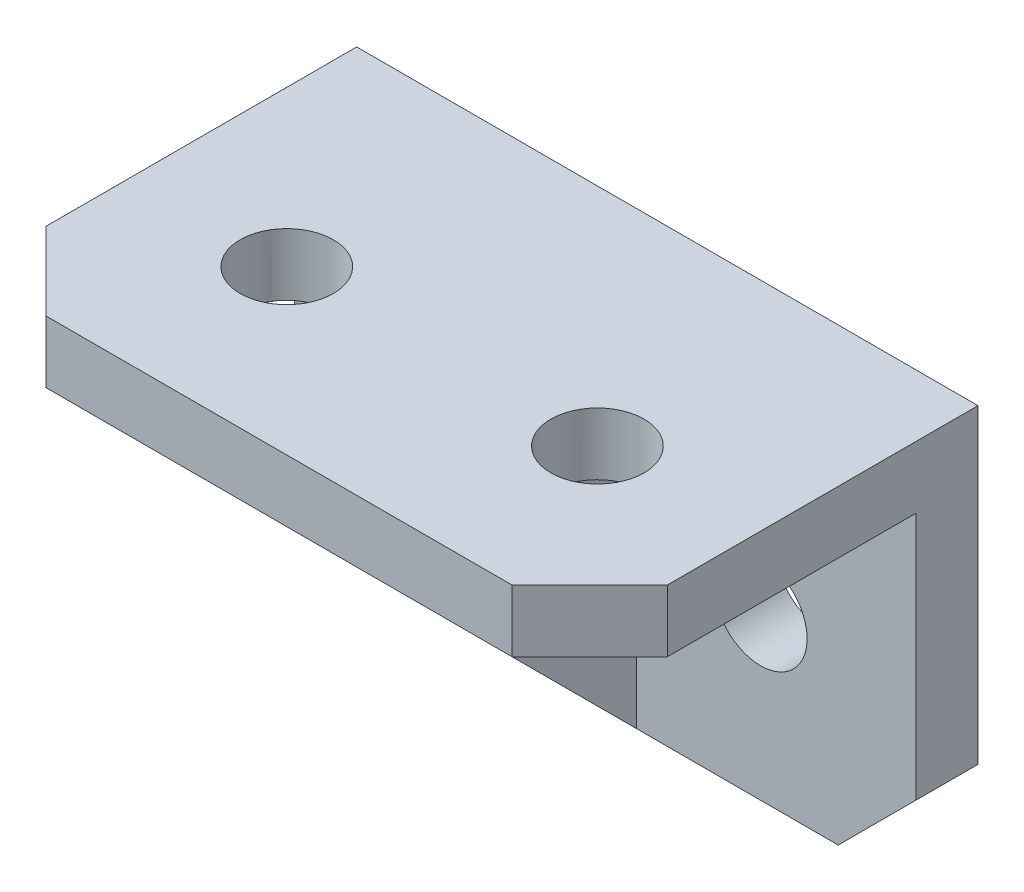
ISO-10303-21;
HEADER;
FILE_DESCRIPTION(('STEP AP214'),'2;1');
FILE_NAME('part.step','',(''),(''),'','','');
FILE_SCHEMA(('AUTOMOTIVE_DESIGN { 1 0 10303 214 1 1 1 1 }'));
ENDSEC;
DATA;
#1=APPLICATION_CONTEXT('core data for automotive mechanical design processes');
#2=APPLICATION_PROTOCOL_DEFINITION('international standard','automotive_design',2000,#1);
#3=PRODUCT_CONTEXT('',#1,'mechanical');
#4=PRODUCT('Part','Part','',(#3));
#5=PRODUCT_RELATED_PRODUCT_CATEGORY('part','',(#4));
#6=PRODUCT_DEFINITION_FORMATION('','',#4);
#7=PRODUCT_DEFINITION_CONTEXT('part definition',#1,'design');
#8=PRODUCT_DEFINITION('design','',#6,#7);
#9=PRODUCT_DEFINITION_SHAPE('','',#8);
#10=(LENGTH_UNIT() NAMED_UNIT(*) SI_UNIT(.MILLI.,.METRE.));
#11=(NAMED_UNIT(*) PLANE_ANGLE_UNIT() SI_UNIT($,.RADIAN.));
#12=(NAMED_UNIT(*) SI_UNIT($,.STERADIAN.) SOLID_ANGLE_UNIT());
#13=UNCERTAINTY_MEASURE_WITH_UNIT(LENGTH_MEASURE(1.E-05),#10,'distance_accuracy_value','');
#14=(GEOMETRIC_REPRESENTATION_CONTEXT(3) GLOBAL_UNCERTAINTY_ASSIGNED_CONTEXT((#13)) GLOBAL_UNIT_ASSIGNED_CONTEXT((#10,
#11,#12)) REPRESENTATION_CONTEXT('',''));
#15=CARTESIAN_POINT('',(0.,0.,0.));
#16=DIRECTION('',(0.,0.,1.));
#17=DIRECTION('',(1.,0.,0.));
#18=AXIS2_PLACEMENT_3D('',#15,#16,#17);
#19=CARTESIAN_POINT('',(-10.,-2.41801961126023,-36.));
#20=DIRECTION('',(0.,0.,1.));
#21=DIRECTION('',(-1.,0.,0.));
#22=AXIS2_PLACEMENT_3D('',#19,#20,#21);
#23=CYLINDRICAL_SURFACE('',#22,3.);
#24=CARTESIAN_POINT('',(-10.,-2.41801961126023,2.22044604925032E-13));
#25=DIRECTION('',(0.,0.,1.));
#26=DIRECTION('',(0.,1.,0.));
#27=AXIS2_PLACEMENT_3D('',#24,#25,#26);
#28=CIRCLE('',#27,3.);
#29=CARTESIAN_POINT('',(-10.,0.58198038873977,2.22044604925032E-13));
#30=VERTEX_POINT('',#29);
#31=EDGE_CURVE('E11',#30,#30,#28,.T.);
#32=ORIENTED_EDGE('',*,*,#31,.F.);
#33=EDGE_LOOP('',(#32));
#34=FACE_BOUND('',#33,.T.);
#35=CARTESIAN_POINT('',(-10.,-2.41801961126023,4.00000000000022));
#36=DIRECTION('',(0.,0.,1.));
#37=DIRECTION('',(-1.,0.,0.));
#38=AXIS2_PLACEMENT_3D('',#35,#36,#37);
#39=CIRCLE('',#38,3.);
#40=CARTESIAN_POINT('',(-13.,-2.41801961126026,4.00000000000022));
#41=VERTEX_POINT('',#40);
#42=EDGE_CURVE('E23',#41,#41,#39,.T.);
#43=ORIENTED_EDGE('',*,*,#42,.T.);
#44=EDGE_LOOP('',(#43));
#45=FACE_BOUND('',#44,.T.);
#46=ADVANCED_FACE('F16',(#34,#45),#23,.F.);
#47=CARTESIAN_POINT('',(10.,-2.41801961126023,-36.));
#48=DIRECTION('',(0.,0.,1.));
#49=DIRECTION('',(-1.,0.,0.));
#50=AXIS2_PLACEMENT_3D('',#47,#48,#49);
#51=CYLINDRICAL_SURFACE('',#50,3.);
#52=CARTESIAN_POINT('',(10.,-2.41801961126023,2.22044604925032E-13));
#53=DIRECTION('',(0.,0.,1.));
#54=DIRECTION('',(0.,1.,0.));
#55=AXIS2_PLACEMENT_3D('',#52,#53,#54);
#56=CIRCLE('',#55,3.);
#57=CARTESIAN_POINT('',(9.99999999999997,0.58198038873977,2.22044604925032E-13));
#58=VERTEX_POINT('',#57);
#59=EDGE_CURVE('E320',#58,#58,#56,.T.);
#60=ORIENTED_EDGE('',*,*,#59,.F.);
#61=EDGE_LOOP('',(#60));
#62=FACE_BOUND('',#61,.T.);
#63=CARTESIAN_POINT('',(10.,-2.41801961126023,4.00000000000022));
#64=DIRECTION('',(0.,0.,1.));
#65=DIRECTION('',(-1.,0.,0.));
#66=AXIS2_PLACEMENT_3D('',#63,#64,#65);
#67=CIRCLE('',#66,3.);
#68=CARTESIAN_POINT('',(7.,-2.41801961126026,4.00000000000022));
#69=VERTEX_POINT('',#68);
#70=EDGE_CURVE('E317',#69,#69,#67,.T.);
#71=ORIENTED_EDGE('',*,*,#70,.T.);
#72=EDGE_LOOP('',(#71));
#73=FACE_BOUND('',#72,.T.);
#74=ADVANCED_FACE('F343',(#62,#73),#51,.F.);
#75=CARTESIAN_POINT('',(-10.0000000000006,48.0819803887395,14.5000000000002));
#76=DIRECTION('',(0.,-1.,0.));
#77=DIRECTION('',(0.,0.,1.));
#78=AXIS2_PLACEMENT_3D('',#75,#76,#77);
#79=CYLINDRICAL_SURFACE('',#78,3.);
#80=CARTESIAN_POINT('',(-10.0000000000002,12.0819803887395,14.5000000000002));
#81=DIRECTION('',(0.,-1.,0.));
#82=DIRECTION('',(1.,0.,0.));
#83=AXIS2_PLACEMENT_3D('',#80,#81,#82);
#84=CIRCLE('',#83,3.);
#85=CARTESIAN_POINT('',(-7.00000000000018,12.0819803887395,14.5000000000002));
#86=VERTEX_POINT('',#85);
#87=EDGE_CURVE('E314',#86,#86,#84,.T.);
#88=ORIENTED_EDGE('',*,*,#87,.F.);
#89=EDGE_LOOP('',(#88));
#90=FACE_BOUND('',#89,.T.);
#91=CARTESIAN_POINT('',(-10.,8.08198038873947,14.5000000000002));
#92=DIRECTION('',(0.,-1.,0.));
#93=DIRECTION('',(0.,0.,1.));
#94=AXIS2_PLACEMENT_3D('',#91,#92,#93);
#95=CIRCLE('',#94,3.);
#96=CARTESIAN_POINT('',(-10.,8.08198038873947,17.5000000000002));
#97=VERTEX_POINT('',#96);
#98=EDGE_CURVE('E311',#97,#97,#95,.T.);
#99=ORIENTED_EDGE('',*,*,#98,.T.);
#100=EDGE_LOOP('',(#99));
#101=FACE_BOUND('',#100,.T.);
#102=ADVANCED_FACE('F338',(#90,#101),#79,.F.);
#103=CARTESIAN_POINT('',(9.99999999999947,48.0819803887398,14.5000000000002));
#104=DIRECTION('',(0.,-1.,0.));
#105=DIRECTION('',(0.,0.,1.));
#106=AXIS2_PLACEMENT_3D('',#103,#104,#105);
#107=CYLINDRICAL_SURFACE('',#106,3.);
#108=CARTESIAN_POINT('',(9.99999999999984,12.0819803887398,14.5000000000002));
#109=DIRECTION('',(0.,-1.,0.));
#110=DIRECTION('',(1.,0.,0.));
#111=AXIS2_PLACEMENT_3D('',#108,#109,#110);
#112=CIRCLE('',#111,3.);
#113=CARTESIAN_POINT('',(12.9999999999998,12.0819803887398,14.5000000000002));
#114=VERTEX_POINT('',#113);
#115=EDGE_CURVE('E308',#114,#114,#112,.T.);
#116=ORIENTED_EDGE('',*,*,#115,.F.);
#117=EDGE_LOOP('',(#116));
#118=FACE_BOUND('',#117,.T.);
#119=CARTESIAN_POINT('',(9.99999999999988,8.08198038873977,14.5000000000002));
#120=DIRECTION('',(0.,-1.,0.));
#121=DIRECTION('',(0.,0.,1.));
#122=AXIS2_PLACEMENT_3D('',#119,#120,#121);
#123=CIRCLE('',#122,3.);
#124=CARTESIAN_POINT('',(9.99999999999988,8.08198038873977,17.5000000000002));
#125=VERTEX_POINT('',#124);
#126=EDGE_CURVE('E303',#125,#125,#123,.T.);
#127=ORIENTED_EDGE('',*,*,#126,.T.);
#128=EDGE_LOOP('',(#127));
#129=FACE_BOUND('',#128,.T.);
#130=ADVANCED_FACE('F329',(#118,#129),#107,.F.);
#131=CARTESIAN_POINT('',(-20.,8.08198038873937,4.00000000000022));
#132=DIRECTION('',(0.,0.,-1.));
#133=DIRECTION('',(1.,0.,0.));
#134=AXIS2_PLACEMENT_3D('',#131,#132,#133);
#135=PLANE('',#134);
#136=ORIENTED_EDGE('',*,*,#42,.F.);
#137=EDGE_LOOP('',(#136));
#138=FACE_BOUND('',#137,.T.);
#139=DIRECTION('',(0.,1.,0.));
#140=VECTOR('',#139,1.);
#141=CARTESIAN_POINT('',(-20.,8.08198038873937,4.00000000000022));
#142=LINE('',#141,#140);
#143=CARTESIAN_POINT('',(-20.,-7.91801961126023,4.00000000000022));
#144=VERTEX_POINT('',#143);
#145=CARTESIAN_POINT('',(-20.,8.08198038873937,4.00000000000022));
#146=VERTEX_POINT('',#145);
#147=EDGE_CURVE('E30',#144,#146,#142,.T.);
#148=ORIENTED_EDGE('',*,*,#147,.F.);
#149=DIRECTION('',(0.707106781186556,-0.70710678118654,0.));
#150=VECTOR('',#149,1.);
#151=CARTESIAN_POINT('',(-20.,-7.91801961126023,4.00000000000022));
#152=LINE('',#151,#150);
#153=CARTESIAN_POINT('',(-15.,-12.9180196112602,4.00000000000022));
#154=VERTEX_POINT('',#153);
#155=EDGE_CURVE('E35',#144,#154,#152,.T.);
#156=ORIENTED_EDGE('',*,*,#155,.T.);
#157=DIRECTION('',(1.,0.,0.));
#158=VECTOR('',#157,1.);
#159=CARTESIAN_POINT('',(-20.,-12.9180196112602,4.00000000000022));
#160=LINE('',#159,#158);
#161=CARTESIAN_POINT('',(-1.9999999999999,-12.9180196112602,4.00000000000022));
#162=VERTEX_POINT('',#161);
#163=EDGE_CURVE('E293',#154,#162,#160,.T.);
#164=ORIENTED_EDGE('',*,*,#163,.T.);
#165=DIRECTION('',(0.,-1.,0.));
#166=VECTOR('',#165,1.);
#167=CARTESIAN_POINT('',(-2.0000000000001,8.08198038873977,4.00000000000022));
#168=LINE('',#167,#166);
#169=CARTESIAN_POINT('',(-2.0000000000001,8.08198038873977,4.00000000000022));
#170=VERTEX_POINT('',#169);
#171=EDGE_CURVE('E288',#170,#162,#168,.T.);
#172=ORIENTED_EDGE('',*,*,#171,.F.);
#173=DIRECTION('',(1.,0.,0.));
#174=VECTOR('',#173,1.);
#175=CARTESIAN_POINT('',(-20.,8.08198038873937,4.00000000000022));
#176=LINE('',#175,#174);
#177=EDGE_CURVE('E283',#146,#170,#176,.T.);
#178=ORIENTED_EDGE('',*,*,#177,.F.);
#179=EDGE_LOOP('',(#148,#156,#164,#172,#178));
#180=FACE_BOUND('',#179,.T.);
#181=ADVANCED_FACE('F326',(#138,#180),#135,.F.);
#182=ORIENTED_EDGE('',*,*,#70,.F.);
#183=EDGE_LOOP('',(#182));
#184=FACE_BOUND('',#183,.T.);
#185=DIRECTION('',(1.,0.,0.));
#186=VECTOR('',#185,1.);
#187=CARTESIAN_POINT('',(-20.,-12.9180196112602,4.00000000000022));
#188=LINE('',#187,#186);
#189=CARTESIAN_POINT('',(2.0000000000001,-12.9180196112602,4.00000000000022));
#190=VERTEX_POINT('',#189);
#191=CARTESIAN_POINT('',(15.,-12.9180196112602,4.00000000000022));
#192=VERTEX_POINT('',#191);
#193=EDGE_CURVE('E279',#190,#192,#188,.T.);
#194=ORIENTED_EDGE('',*,*,#193,.T.);
#195=DIRECTION('',(0.707106781186539,0.707106781186556,0.));
#196=VECTOR('',#195,1.);
#197=CARTESIAN_POINT('',(15.,-12.9180196112602,4.00000000000022));
#198=LINE('',#197,#196);
#199=CARTESIAN_POINT('',(20.,-7.91801961126023,4.00000000000022));
#200=VERTEX_POINT('',#199);
#201=EDGE_CURVE('E275',#192,#200,#198,.T.);
#202=ORIENTED_EDGE('',*,*,#201,.T.);
#203=DIRECTION('',(0.,1.,0.));
#204=VECTOR('',#203,1.);
#205=CARTESIAN_POINT('',(20.,8.08198038873977,4.00000000000022));
#206=LINE('',#205,#204);
#207=CARTESIAN_POINT('',(20.,8.08198038873977,4.00000000000022));
#208=VERTEX_POINT('',#207);
#209=EDGE_CURVE('E271',#200,#208,#206,.T.);
#210=ORIENTED_EDGE('',*,*,#209,.T.);
#211=DIRECTION('',(1.,0.,0.));
#212=VECTOR('',#211,1.);
#213=CARTESIAN_POINT('',(-20.,8.08198038873937,4.00000000000022));
#214=LINE('',#213,#212);
#215=CARTESIAN_POINT('',(1.99999999999989,8.08198038873977,4.00000000000022));
#216=VERTEX_POINT('',#215);
#217=EDGE_CURVE('E266',#216,#208,#214,.T.);
#218=ORIENTED_EDGE('',*,*,#217,.F.);
#219=DIRECTION('',(0.,1.,0.));
#220=VECTOR('',#219,1.);
#221=CARTESIAN_POINT('',(1.99999999999989,8.08198038873977,4.00000000000022));
#222=LINE('',#221,#220);
#223=EDGE_CURVE('E261',#190,#216,#222,.T.);
#224=ORIENTED_EDGE('',*,*,#223,.F.);
#225=EDGE_LOOP('',(#194,#202,#210,#218,#224));
#226=FACE_BOUND('',#225,.T.);
#227=ADVANCED_FACE('F328',(#184,#226),#135,.F.);
#228=CARTESIAN_POINT('',(-20.,8.08198038873937,25.));
#229=DIRECTION('',(0.,1.,0.));
#230=DIRECTION('',(0.,0.,-1.));
#231=AXIS2_PLACEMENT_3D('',#228,#229,#230);
#232=PLANE('',#231);
#233=ORIENTED_EDGE('',*,*,#98,.F.);
#234=EDGE_LOOP('',(#233));
#235=FACE_BOUND('',#234,.T.);
#236=DIRECTION('',(1.,0.,0.));
#237=VECTOR('',#236,1.);
#238=CARTESIAN_POINT('',(-20.,8.08198038873937,25.));
#239=LINE('',#238,#237);
#240=CARTESIAN_POINT('',(-15.,8.08198038873947,25.));
#241=VERTEX_POINT('',#240);
#242=CARTESIAN_POINT('',(-2.00000000000007,8.08198038873977,25.));
#243=VERTEX_POINT('',#242);
#244=EDGE_CURVE('E256',#241,#243,#239,.T.);
#245=ORIENTED_EDGE('',*,*,#244,.F.);
#246=DIRECTION('',(-0.707106781186549,0.,-0.707106781186547));
#247=VECTOR('',#246,1.);
#248=CARTESIAN_POINT('',(-20.,8.08198038873937,20.0000000000002));
#249=LINE('',#248,#247);
#250=CARTESIAN_POINT('',(-20.,8.08198038873937,20.0000000000002));
#251=VERTEX_POINT('',#250);
#252=EDGE_CURVE('E252',#241,#251,#249,.T.);
#253=ORIENTED_EDGE('',*,*,#252,.T.);
#254=DIRECTION('',(0.,0.,1.));
#255=VECTOR('',#254,1.);
#256=CARTESIAN_POINT('',(-20.,8.08198038873937,25.));
#257=LINE('',#256,#255);
#258=EDGE_CURVE('E247',#146,#251,#257,.T.);
#259=ORIENTED_EDGE('',*,*,#258,.F.);
#260=ORIENTED_EDGE('',*,*,#177,.T.);
#261=DIRECTION('',(0.,0.,-1.));
#262=VECTOR('',#261,1.);
#263=CARTESIAN_POINT('',(-2.00000000000007,8.08198038873977,25.));
#264=LINE('',#263,#262);
#265=EDGE_CURVE('E242',#243,#170,#264,.T.);
#266=ORIENTED_EDGE('',*,*,#265,.F.);
#267=EDGE_LOOP('',(#245,#253,#259,#260,#266));
#268=FACE_BOUND('',#267,.T.);
#269=ADVANCED_FACE('F336',(#235,#268),#232,.F.);
#270=ORIENTED_EDGE('',*,*,#126,.F.);
#271=EDGE_LOOP('',(#270));
#272=FACE_BOUND('',#271,.T.);
#273=DIRECTION('',(0.,0.,1.));
#274=VECTOR('',#273,1.);
#275=CARTESIAN_POINT('',(20.,8.08198038873977,25.));
#276=LINE('',#275,#274);
#277=CARTESIAN_POINT('',(20.,8.08198038873977,20.0000000000002));
#278=VERTEX_POINT('',#277);
#279=EDGE_CURVE('E238',#208,#278,#276,.T.);
#280=ORIENTED_EDGE('',*,*,#279,.T.);
#281=DIRECTION('',(-0.707106781186546,0.,0.707106781186549));
#282=VECTOR('',#281,1.);
#283=CARTESIAN_POINT('',(14.9999999999999,8.08198038873977,25.));
#284=LINE('',#283,#282);
#285=CARTESIAN_POINT('',(14.9999999999999,8.08198038873977,25.));
#286=VERTEX_POINT('',#285);
#287=EDGE_CURVE('E135',#278,#286,#284,.T.);
#288=ORIENTED_EDGE('',*,*,#287,.T.);
#289=DIRECTION('',(1.,0.,0.));
#290=VECTOR('',#289,1.);
#291=CARTESIAN_POINT('',(-20.,8.08198038873937,25.));
#292=LINE('',#291,#290);
#293=CARTESIAN_POINT('',(1.99999999999988,8.08198038873977,25.));
#294=VERTEX_POINT('',#293);
#295=EDGE_CURVE('E230',#294,#286,#292,.T.);
#296=ORIENTED_EDGE('',*,*,#295,.F.);
#297=DIRECTION('',(0.,0.,-1.));
#298=VECTOR('',#297,1.);
#299=CARTESIAN_POINT('',(1.99999999999988,8.08198038873977,25.));
#300=LINE('',#299,#298);
#301=EDGE_CURVE('E225',#294,#216,#300,.T.);
#302=ORIENTED_EDGE('',*,*,#301,.T.);
#303=ORIENTED_EDGE('',*,*,#217,.T.);
#304=EDGE_LOOP('',(#280,#288,#296,#302,#303));
#305=FACE_BOUND('',#304,.T.);
#306=ADVANCED_FACE('F355',(#272,#305),#232,.F.);
#307=CARTESIAN_POINT('',(-20.,-12.9180196112602,2.22044604925032E-13));
#308=DIRECTION('',(0.,0.,1.));
#309=DIRECTION('',(0.,1.,0.));
#310=AXIS2_PLACEMENT_3D('',#307,#308,#309);
#311=PLANE('',#310);
#312=ORIENTED_EDGE('',*,*,#31,.T.);
#313=EDGE_LOOP('',(#312));
#314=FACE_BOUND('',#313,.T.);
#315=ORIENTED_EDGE('',*,*,#59,.T.);
#316=EDGE_LOOP('',(#315));
#317=FACE_BOUND('',#316,.T.);
#318=DIRECTION('',(1.,0.,0.));
#319=VECTOR('',#318,1.);
#320=CARTESIAN_POINT('',(-20.,-12.9180196112602,2.22044604925032E-13));
#321=LINE('',#320,#319);
#322=CARTESIAN_POINT('',(-15.,-12.9180196112602,2.22044604925032E-13));
#323=VERTEX_POINT('',#322);
#324=CARTESIAN_POINT('',(15.,-12.9180196112602,2.22044604925032E-13));
#325=VERTEX_POINT('',#324);
#326=EDGE_CURVE('E220',#323,#325,#321,.T.);
#327=ORIENTED_EDGE('',*,*,#326,.F.);
#328=DIRECTION('',(-0.707106781186556,0.70710678118654,0.));
#329=VECTOR('',#328,1.);
#330=CARTESIAN_POINT('',(-20.,-7.91801961126023,2.22044604925032E-13));
#331=LINE('',#330,#329);
#332=CARTESIAN_POINT('',(-20.,-7.91801961126023,2.22044604925032E-13));
#333=VERTEX_POINT('',#332);
#334=EDGE_CURVE('E216',#323,#333,#331,.T.);
#335=ORIENTED_EDGE('',*,*,#334,.T.);
#336=DIRECTION('',(0.,-1.,0.));
#337=VECTOR('',#336,1.);
#338=CARTESIAN_POINT('',(-20.,-12.9180196112602,2.22044604925032E-13));
#339=LINE('',#338,#337);
#340=CARTESIAN_POINT('',(-20.,12.0819803887394,2.22044604925032E-13));
#341=VERTEX_POINT('',#340);
#342=EDGE_CURVE('E211',#341,#333,#339,.T.);
#343=ORIENTED_EDGE('',*,*,#342,.F.);
#344=DIRECTION('',(1.,0.,0.));
#345=VECTOR('',#344,1.);
#346=CARTESIAN_POINT('',(-20.,12.0819803887394,2.22044604925032E-13));
#347=LINE('',#346,#345);
#348=CARTESIAN_POINT('',(20.,12.0819803887398,2.22044604925032E-13));
#349=VERTEX_POINT('',#348);
#350=EDGE_CURVE('E207',#341,#349,#347,.T.);
#351=ORIENTED_EDGE('',*,*,#350,.T.);
#352=DIRECTION('',(0.,-1.,0.));
#353=VECTOR('',#352,1.);
#354=CARTESIAN_POINT('',(20.,-12.9180196112602,2.22044604925032E-13));
#355=LINE('',#354,#353);
#356=CARTESIAN_POINT('',(20.,-7.91801961126023,2.22044604925032E-13));
#357=VERTEX_POINT('',#356);
#358=EDGE_CURVE('E131',#349,#357,#355,.T.);
#359=ORIENTED_EDGE('',*,*,#358,.T.);
#360=DIRECTION('',(-0.707106781186539,-0.707106781186556,0.));
#361=VECTOR('',#360,1.);
#362=CARTESIAN_POINT('',(15.,-12.9180196112602,2.22044604925032E-13));
#363=LINE('',#362,#361);
#364=EDGE_CURVE('E200',#357,#325,#363,.T.);
#365=ORIENTED_EDGE('',*,*,#364,.T.);
#366=EDGE_LOOP('',(#327,#335,#343,#351,#359,#365));
#367=FACE_BOUND('',#366,.T.);
#368=ADVANCED_FACE('F351',(#314,#317,#367),#311,.F.);
#369=CARTESIAN_POINT('',(-20.,-12.9180196112602,4.00000000000022));
#370=DIRECTION('',(0.,1.,0.));
#371=DIRECTION('',(-1.,0.,0.));
#372=AXIS2_PLACEMENT_3D('',#369,#370,#371);
#373=PLANE('',#372);
#374=ORIENTED_EDGE('',*,*,#163,.F.);
#375=DIRECTION('',(0.,0.,-1.));
#376=VECTOR('',#375,1.);
#377=CARTESIAN_POINT('',(-15.,-12.9180196112602,4.00000000000022));
#378=LINE('',#377,#376);
#379=EDGE_CURVE('E195',#154,#323,#378,.T.);
#380=ORIENTED_EDGE('',*,*,#379,.T.);
#381=ORIENTED_EDGE('',*,*,#326,.T.);
#382=DIRECTION('',(0.,0.,1.));
#383=VECTOR('',#382,1.);
#384=CARTESIAN_POINT('',(15.,-12.9180196112602,4.00000000000022));
#385=LINE('',#384,#383);
#386=EDGE_CURVE('E190',#325,#192,#385,.T.);
#387=ORIENTED_EDGE('',*,*,#386,.T.);
#388=ORIENTED_EDGE('',*,*,#193,.F.);
#389=DIRECTION('',(-1.,0.,0.));
#390=VECTOR('',#389,1.);
#391=CARTESIAN_POINT('',(19.,-12.9180196112602,4.00000000000022));
#392=LINE('',#391,#390);
#393=EDGE_CURVE('E185',#190,#162,#392,.T.);
#394=ORIENTED_EDGE('',*,*,#393,.T.);
#395=EDGE_LOOP('',(#374,#380,#381,#387,#388,#394));
#396=FACE_BOUND('',#395,.T.);
#397=ADVANCED_FACE('F354',(#396),#373,.F.);
#398=CARTESIAN_POINT('',(-20.,12.0819803887394,25.));
#399=DIRECTION('',(0.,0.,-1.));
#400=DIRECTION('',(1.,0.,0.));
#401=AXIS2_PLACEMENT_3D('',#398,#399,#400);
#402=PLANE('',#401);
#403=DIRECTION('',(1.,0.,0.));
#404=VECTOR('',#403,1.);
#405=CARTESIAN_POINT('',(-20.,12.0819803887394,25.));
#406=LINE('',#405,#404);
#407=CARTESIAN_POINT('',(-15.,12.0819803887395,25.));
#408=VERTEX_POINT('',#407);
#409=CARTESIAN_POINT('',(14.9999999999998,12.0819803887398,25.));
#410=VERTEX_POINT('',#409);
#411=EDGE_CURVE('E117',#408,#410,#406,.T.);
#412=ORIENTED_EDGE('',*,*,#411,.F.);
#413=DIRECTION('',(0.,-1.,0.));
#414=VECTOR('',#413,1.);
#415=CARTESIAN_POINT('',(-15.,12.0819803887395,25.));
#416=LINE('',#415,#414);
#417=EDGE_CURVE('E177',#408,#241,#416,.T.);
#418=ORIENTED_EDGE('',*,*,#417,.T.);
#419=ORIENTED_EDGE('',*,*,#244,.T.);
#420=DIRECTION('',(-1.,0.,0.));
#421=VECTOR('',#420,1.);
#422=CARTESIAN_POINT('',(19.,8.08198038873977,25.));
#423=LINE('',#422,#421);
#424=EDGE_CURVE('E172',#294,#243,#423,.T.);
#425=ORIENTED_EDGE('',*,*,#424,.F.);
#426=ORIENTED_EDGE('',*,*,#295,.T.);
#427=DIRECTION('',(0.,1.,0.));
#428=VECTOR('',#427,1.);
#429=CARTESIAN_POINT('',(14.9999999999998,12.0819803887398,25.));
#430=LINE('',#429,#428);
#431=EDGE_CURVE('E168',#286,#410,#430,.T.);
#432=ORIENTED_EDGE('',*,*,#431,.T.);
#433=EDGE_LOOP('',(#412,#418,#419,#425,#426,#432));
#434=FACE_BOUND('',#433,.T.);
#435=ADVANCED_FACE('F377',(#434),#402,.F.);
#436=CARTESIAN_POINT('',(-20.,12.0819803887394,2.22044604925032E-13));
#437=DIRECTION('',(0.,-1.,0.));
#438=DIRECTION('',(1.,0.,0.));
#439=AXIS2_PLACEMENT_3D('',#436,#437,#438);
#440=PLANE('',#439);
#441=ORIENTED_EDGE('',*,*,#87,.T.);
#442=EDGE_LOOP('',(#441));
#443=FACE_BOUND('',#442,.T.);
#444=ORIENTED_EDGE('',*,*,#115,.T.);
#445=EDGE_LOOP('',(#444));
#446=FACE_BOUND('',#445,.T.);
#447=DIRECTION('',(0.,0.,-1.));
#448=VECTOR('',#447,1.);
#449=CARTESIAN_POINT('',(-20.,12.0819803887394,2.22044604925032E-13));
#450=LINE('',#449,#448);
#451=CARTESIAN_POINT('',(-20.,12.0819803887394,20.0000000000002));
#452=VERTEX_POINT('',#451);
#453=EDGE_CURVE('E163',#452,#341,#450,.T.);
#454=ORIENTED_EDGE('',*,*,#453,.F.);
#455=DIRECTION('',(0.707106781186549,0.,0.707106781186547));
#456=VECTOR('',#455,1.);
#457=CARTESIAN_POINT('',(-20.,12.0819803887394,20.0000000000002));
#458=LINE('',#457,#456);
#459=EDGE_CURVE('E121',#452,#408,#458,.T.);
#460=ORIENTED_EDGE('',*,*,#459,.T.);
#461=ORIENTED_EDGE('',*,*,#411,.T.);
#462=DIRECTION('',(0.707106781186546,0.,-0.707106781186549));
#463=VECTOR('',#462,1.);
#464=CARTESIAN_POINT('',(14.9999999999998,12.0819803887398,25.));
#465=LINE('',#464,#463);
#466=CARTESIAN_POINT('',(20.,12.0819803887398,20.0000000000002));
#467=VERTEX_POINT('',#466);
#468=EDGE_CURVE('E110',#410,#467,#465,.T.);
#469=ORIENTED_EDGE('',*,*,#468,.T.);
#470=DIRECTION('',(0.,0.,-1.));
#471=VECTOR('',#470,1.);
#472=CARTESIAN_POINT('',(20.,12.0819803887398,2.22044604925032E-13));
#473=LINE('',#472,#471);
#474=EDGE_CURVE('E114',#467,#349,#473,.T.);
#475=ORIENTED_EDGE('',*,*,#474,.T.);
#476=ORIENTED_EDGE('',*,*,#350,.F.);
#477=EDGE_LOOP('',(#454,#460,#461,#469,#475,#476));
#478=FACE_BOUND('',#477,.T.);
#479=ADVANCED_FACE('F112',(#443,#446,#478),#440,.F.);
#480=CARTESIAN_POINT('',(-20.,12.0819803887394,2.22044604925032E-13));
#481=DIRECTION('',(1.,0.,0.));
#482=DIRECTION('',(0.,1.,0.));
#483=AXIS2_PLACEMENT_3D('',#480,#481,#482);
#484=PLANE('',#483);
#485=ORIENTED_EDGE('',*,*,#258,.T.);
#486=DIRECTION('',(0.,1.,0.));
#487=VECTOR('',#486,1.);
#488=CARTESIAN_POINT('',(-20.,12.0819803887394,20.0000000000002));
#489=LINE('',#488,#487);
#490=EDGE_CURVE('E132',#251,#452,#489,.T.);
#491=ORIENTED_EDGE('',*,*,#490,.T.);
#492=ORIENTED_EDGE('',*,*,#453,.T.);
#493=ORIENTED_EDGE('',*,*,#342,.T.);
#494=DIRECTION('',(0.,0.,1.));
#495=VECTOR('',#494,1.);
#496=CARTESIAN_POINT('',(-20.,-7.91801961126023,2.22044604925032E-13));
#497=LINE('',#496,#495);
#498=EDGE_CURVE('E139',#333,#144,#497,.T.);
#499=ORIENTED_EDGE('',*,*,#498,.T.);
#500=ORIENTED_EDGE('',*,*,#147,.T.);
#501=EDGE_LOOP('',(#485,#491,#492,#493,#499,#500));
#502=FACE_BOUND('',#501,.T.);
#503=ADVANCED_FACE('F368',(#502),#484,.F.);
#504=CARTESIAN_POINT('',(20.,12.0819803887398,2.22044604925032E-13));
#505=DIRECTION('',(1.,0.,0.));
#506=DIRECTION('',(0.,1.,0.));
#507=AXIS2_PLACEMENT_3D('',#504,#505,#506);
#508=PLANE('',#507);
#509=ORIENTED_EDGE('',*,*,#209,.F.);
#510=DIRECTION('',(0.,0.,-1.));
#511=VECTOR('',#510,1.);
#512=CARTESIAN_POINT('',(20.,-7.91801961126023,2.22044604925032E-13));
#513=LINE('',#512,#511);
#514=EDGE_CURVE('E136',#200,#357,#513,.T.);
#515=ORIENTED_EDGE('',*,*,#514,.T.);
#516=ORIENTED_EDGE('',*,*,#358,.F.);
#517=ORIENTED_EDGE('',*,*,#474,.F.);
#518=DIRECTION('',(0.,-1.,0.));
#519=VECTOR('',#518,1.);
#520=CARTESIAN_POINT('',(20.,8.08198038873977,20.0000000000002));
#521=LINE('',#520,#519);
#522=EDGE_CURVE('E128',#467,#278,#521,.T.);
#523=ORIENTED_EDGE('',*,*,#522,.T.);
#524=ORIENTED_EDGE('',*,*,#279,.F.);
#525=EDGE_LOOP('',(#509,#515,#516,#517,#523,#524));
#526=FACE_BOUND('',#525,.T.);
#527=ADVANCED_FACE('F126',(#526),#508,.T.);
#528=CARTESIAN_POINT('',(-2.00000000000007,8.08198038873977,25.));
#529=DIRECTION('',(1.,0.,0.));
#530=DIRECTION('',(0.,1.,0.));
#531=AXIS2_PLACEMENT_3D('',#528,#529,#530);
#532=PLANE('',#531);
#533=ORIENTED_EDGE('',*,*,#171,.T.);
#534=DIRECTION('',(0.,-0.707106781186548,-0.707106781186548));
#535=VECTOR('',#534,1.);
#536=CARTESIAN_POINT('',(-2.00000000000007,8.08198038873977,25.));
#537=LINE('',#536,#535);
#538=EDGE_CURVE('E137',#243,#162,#537,.T.);
#539=ORIENTED_EDGE('',*,*,#538,.F.);
#540=ORIENTED_EDGE('',*,*,#265,.T.);
#541=EDGE_LOOP('',(#533,#539,#540));
#542=FACE_BOUND('',#541,.T.);
#543=ADVANCED_FACE('F397',(#542),#532,.F.);
#544=CARTESIAN_POINT('',(1.99999999999988,8.08198038873977,25.));
#545=DIRECTION('',(-1.,0.,0.));
#546=DIRECTION('',(0.,-1.,0.));
#547=AXIS2_PLACEMENT_3D('',#544,#545,#546);
#548=PLANE('',#547);
#549=ORIENTED_EDGE('',*,*,#301,.F.);
#550=DIRECTION('',(0.,-0.707106781186548,-0.707106781186548));
#551=VECTOR('',#550,1.);
#552=CARTESIAN_POINT('',(1.99999999999988,8.08198038873977,25.));
#553=LINE('',#552,#551);
#554=EDGE_CURVE('E142',#294,#190,#553,.T.);
#555=ORIENTED_EDGE('',*,*,#554,.T.);
#556=ORIENTED_EDGE('',*,*,#223,.T.);
#557=EDGE_LOOP('',(#549,#555,#556));
#558=FACE_BOUND('',#557,.T.);
#559=ADVANCED_FACE('F392',(#558),#548,.F.);
#560=CARTESIAN_POINT('',(19.,8.08198038873977,25.));
#561=DIRECTION('',(0.,0.707106781186548,-0.707106781186548));
#562=DIRECTION('',(0.,-0.707106781186548,-0.707106781186548));
#563=AXIS2_PLACEMENT_3D('',#560,#561,#562);
#564=PLANE('',#563);
#565=ORIENTED_EDGE('',*,*,#424,.T.);
#566=ORIENTED_EDGE('',*,*,#538,.T.);
#567=ORIENTED_EDGE('',*,*,#393,.F.);
#568=ORIENTED_EDGE('',*,*,#554,.F.);
#569=EDGE_LOOP('',(#565,#566,#567,#568));
#570=FACE_BOUND('',#569,.T.);
#571=ADVANCED_FACE('F395',(#570),#564,.F.);
#572=CARTESIAN_POINT('',(-20.,12.0819803887394,20.0000000000002));
#573=DIRECTION('',(0.707106781186547,0.,-0.707106781186549));
#574=DIRECTION('',(0.,1.,0.));
#575=AXIS2_PLACEMENT_3D('',#572,#573,#574);
#576=PLANE('',#575);
#577=ORIENTED_EDGE('',*,*,#252,.F.);
#578=ORIENTED_EDGE('',*,*,#417,.F.);
#579=ORIENTED_EDGE('',*,*,#459,.F.);
#580=ORIENTED_EDGE('',*,*,#490,.F.);
#581=EDGE_LOOP('',(#577,#578,#579,#580));
#582=FACE_BOUND('',#581,.T.);
#583=ADVANCED_FACE('F375',(#582),#576,.F.);
#584=CARTESIAN_POINT('',(-20.,-7.91801961126023,2.22044604925032E-13));
#585=DIRECTION('',(0.70710678118654,0.707106781186556,0.));
#586=DIRECTION('',(0.,0.,1.));
#587=AXIS2_PLACEMENT_3D('',#584,#585,#586);
#588=PLANE('',#587);
#589=ORIENTED_EDGE('',*,*,#334,.F.);
#590=ORIENTED_EDGE('',*,*,#379,.F.);
#591=ORIENTED_EDGE('',*,*,#155,.F.);
#592=ORIENTED_EDGE('',*,*,#498,.F.);
#593=EDGE_LOOP('',(#589,#590,#591,#592));
#594=FACE_BOUND('',#593,.T.);
#595=ADVANCED_FACE('F366',(#594),#588,.F.);
#596=CARTESIAN_POINT('',(15.,-12.9180196112602,4.00000000000022));
#597=DIRECTION('',(0.707106781186556,-0.707106781186539,0.));
#598=DIRECTION('',(0.,0.,-1.));
#599=AXIS2_PLACEMENT_3D('',#596,#597,#598);
#600=PLANE('',#599);
#601=ORIENTED_EDGE('',*,*,#364,.F.);
#602=ORIENTED_EDGE('',*,*,#514,.F.);
#603=ORIENTED_EDGE('',*,*,#201,.F.);
#604=ORIENTED_EDGE('',*,*,#386,.F.);
#605=EDGE_LOOP('',(#601,#602,#603,#604));
#606=FACE_BOUND('',#605,.T.);
#607=ADVANCED_FACE('F386',(#606),#600,.T.);
#608=CARTESIAN_POINT('',(14.9999999999998,12.0819803887398,25.));
#609=DIRECTION('',(0.707106781186549,0.,0.707106781186546));
#610=DIRECTION('',(0.,-1.,0.));
#611=AXIS2_PLACEMENT_3D('',#608,#609,#610);
#612=PLANE('',#611);
#613=ORIENTED_EDGE('',*,*,#287,.F.);
#614=ORIENTED_EDGE('',*,*,#522,.F.);
#615=ORIENTED_EDGE('',*,*,#468,.F.);
#616=ORIENTED_EDGE('',*,*,#431,.F.);
#617=EDGE_LOOP('',(#613,#614,#615,#616));
#618=FACE_BOUND('',#617,.T.);
#619=ADVANCED_FACE('F134',(#618),#612,.T.);
#620=CLOSED_SHELL('',(#46,#74,#102,#130,#181,#227,#269,#306,#368,#397,#435,#479,#503,#527,#543,
#559,#571,#583,#595,#607,#619));
#621=MANIFOLD_SOLID_BREP('B1',#620);
#622=ADVANCED_BREP_SHAPE_REPRESENTATION('',(#18,#621),#14);
#623=SHAPE_DEFINITION_REPRESENTATION(#9,#622);
ENDSEC;
END-ISO-10303-21;
